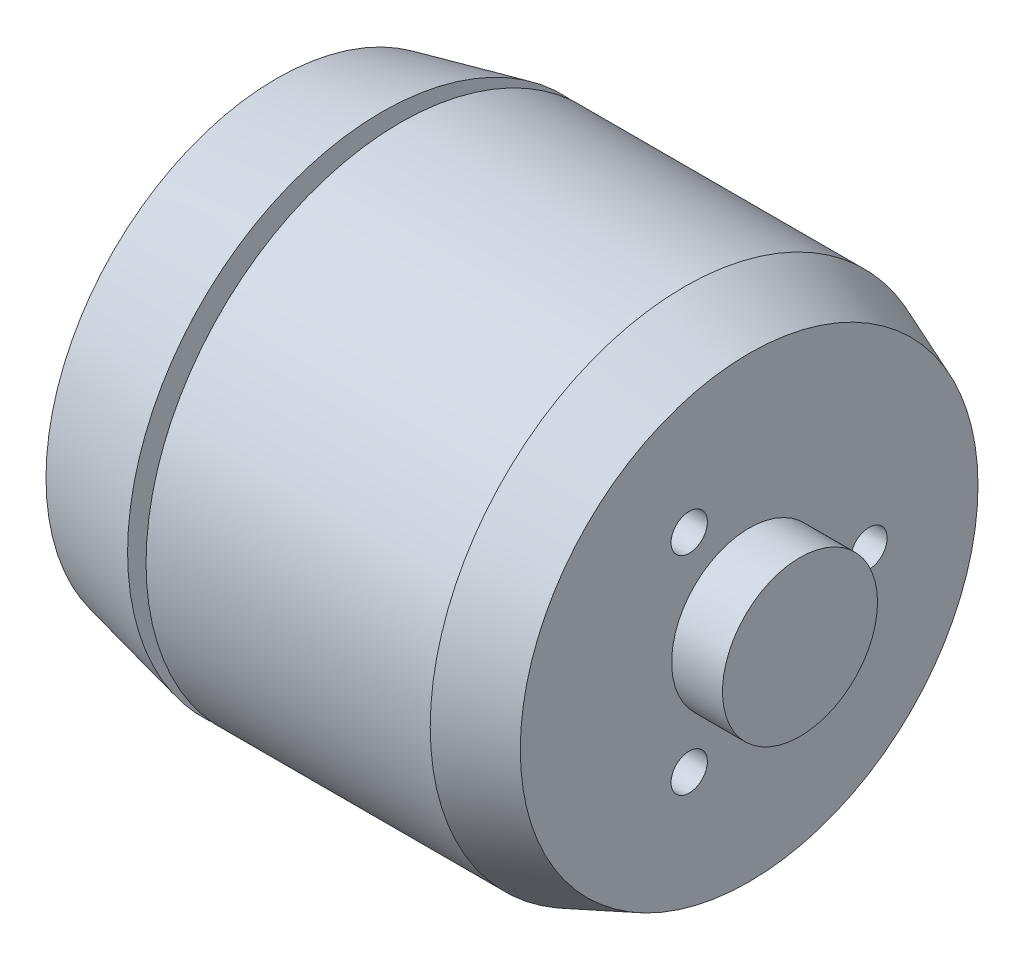
ISO-10303-21;
HEADER;
FILE_DESCRIPTION(('STEP AP214'),'2;1');
FILE_NAME('part.step','',(''),(''),'','','');
FILE_SCHEMA(('AUTOMOTIVE_DESIGN { 1 0 10303 214 1 1 1 1 }'));
ENDSEC;
DATA;
#1=APPLICATION_CONTEXT('core data for automotive mechanical design processes');
#2=APPLICATION_PROTOCOL_DEFINITION('international standard','automotive_design',2000,#1);
#3=PRODUCT_CONTEXT('',#1,'mechanical');
#4=PRODUCT('Part','Part','',(#3));
#5=PRODUCT_RELATED_PRODUCT_CATEGORY('part','',(#4));
#6=PRODUCT_DEFINITION_FORMATION('','',#4);
#7=PRODUCT_DEFINITION_CONTEXT('part definition',#1,'design');
#8=PRODUCT_DEFINITION('design','',#6,#7);
#9=PRODUCT_DEFINITION_SHAPE('','',#8);
#10=(LENGTH_UNIT() NAMED_UNIT(*) SI_UNIT(.MILLI.,.METRE.));
#11=(NAMED_UNIT(*) PLANE_ANGLE_UNIT() SI_UNIT($,.RADIAN.));
#12=(NAMED_UNIT(*) SI_UNIT($,.STERADIAN.) SOLID_ANGLE_UNIT());
#13=UNCERTAINTY_MEASURE_WITH_UNIT(LENGTH_MEASURE(1.E-05),#10,'distance_accuracy_value','');
#14=(GEOMETRIC_REPRESENTATION_CONTEXT(3) GLOBAL_UNCERTAINTY_ASSIGNED_CONTEXT((#13)) GLOBAL_UNIT_ASSIGNED_CONTEXT((#10,
#11,#12)) REPRESENTATION_CONTEXT('',''));
#15=CARTESIAN_POINT('',(0.,0.,0.));
#16=DIRECTION('',(0.,0.,1.));
#17=DIRECTION('',(1.,0.,0.));
#18=AXIS2_PLACEMENT_3D('',#15,#16,#17);
#19=CARTESIAN_POINT('',(28.5,7.1428,4.12389750276767));
#20=DIRECTION('',(1.,0.,0.));
#21=DIRECTION('',(0.,1.,0.));
#22=AXIS2_PLACEMENT_3D('',#19,#20,#21);
#23=PLANE('',#22);
#24=CARTESIAN_POINT('',(28.5,7.1428,4.12389750276767));
#25=DIRECTION('',(1.,0.,0.));
#26=DIRECTION('',(0.,0.,-1.));
#27=AXIS2_PLACEMENT_3D('',#24,#25,#26);
#28=CIRCLE('',#27,1.25);
#29=CARTESIAN_POINT('',(28.5,7.1428,5.37389750276767));
#30=VERTEX_POINT('',#29);
#31=EDGE_CURVE('E273',#30,#30,#28,.T.);
#32=ORIENTED_EDGE('',*,*,#31,.T.);
#33=EDGE_LOOP('',(#32));
#34=FACE_BOUND('',#33,.T.);
#35=ADVANCED_FACE('F17',(#34),#23,.T.);
#36=CARTESIAN_POINT('',(28.5,-7.1428,4.12389750276767));
#37=DIRECTION('',(1.,0.,0.));
#38=DIRECTION('',(0.,1.,0.));
#39=AXIS2_PLACEMENT_3D('',#36,#37,#38);
#40=PLANE('',#39);
#41=CARTESIAN_POINT('',(28.5,-7.1428,4.12389750276767));
#42=DIRECTION('',(1.,0.,0.));
#43=DIRECTION('',(0.,0.,-1.));
#44=AXIS2_PLACEMENT_3D('',#41,#42,#43);
#45=CIRCLE('',#44,1.25);
#46=CARTESIAN_POINT('',(28.5,-7.1428,5.37389750276767));
#47=VERTEX_POINT('',#46);
#48=EDGE_CURVE('E280',#47,#47,#45,.T.);
#49=ORIENTED_EDGE('',*,*,#48,.T.);
#50=EDGE_LOOP('',(#49));
#51=FACE_BOUND('',#50,.T.);
#52=ADVANCED_FACE('F644',(#51),#40,.T.);
#53=CARTESIAN_POINT('',(28.5,0.,-8.24779500553533));
#54=DIRECTION('',(1.,0.,0.));
#55=DIRECTION('',(0.,1.,0.));
#56=AXIS2_PLACEMENT_3D('',#53,#54,#55);
#57=PLANE('',#56);
#58=CARTESIAN_POINT('',(28.5,0.,-8.24779500553533));
#59=DIRECTION('',(1.,0.,0.));
#60=DIRECTION('',(0.,0.,-1.));
#61=AXIS2_PLACEMENT_3D('',#58,#59,#60);
#62=CIRCLE('',#61,1.25);
#63=CARTESIAN_POINT('',(28.5,0.,-6.99779500553533));
#64=VERTEX_POINT('',#63);
#65=EDGE_CURVE('E221',#64,#64,#62,.T.);
#66=ORIENTED_EDGE('',*,*,#65,.T.);
#67=EDGE_LOOP('',(#66));
#68=FACE_BOUND('',#67,.T.);
#69=ADVANCED_FACE('F649',(#68),#57,.T.);
#70=CARTESIAN_POINT('',(0.,0.,0.));
#71=DIRECTION('',(0.,0.,-1.));
#72=DIRECTION('',(0.,-1.,0.));
#73=AXIS2_PLACEMENT_3D('',#70,#71,#72);
#74=PLANE('',#73);
#75=DIRECTION('',(0.,1.,0.));
#76=VECTOR('',#75,1.);
#77=CARTESIAN_POINT('',(6.9854,-5.08,0.));
#78=LINE('',#77,#76);
#79=CARTESIAN_POINT('',(6.9854,-5.08,0.));
#80=VERTEX_POINT('',#79);
#81=CARTESIAN_POINT('',(6.9854,5.08,0.));
#82=VERTEX_POINT('',#81);
#83=EDGE_CURVE('E298',#80,#82,#78,.T.);
#84=ORIENTED_EDGE('',*,*,#83,.F.);
#85=DIRECTION('',(1.,0.,0.));
#86=VECTOR('',#85,1.);
#87=CARTESIAN_POINT('',(2.2356,-5.08,0.));
#88=LINE('',#87,#86);
#89=CARTESIAN_POINT('',(2.2356,-5.08,0.));
#90=VERTEX_POINT('',#89);
#91=EDGE_CURVE('E242',#90,#80,#88,.T.);
#92=ORIENTED_EDGE('',*,*,#91,.F.);
#93=DIRECTION('',(0.,-1.,0.));
#94=VECTOR('',#93,1.);
#95=CARTESIAN_POINT('',(2.2356,-5.08,0.));
#96=LINE('',#95,#94);
#97=CARTESIAN_POINT('',(2.2356,5.08,0.));
#98=VERTEX_POINT('',#97);
#99=EDGE_CURVE('E11',#98,#90,#96,.T.);
#100=ORIENTED_EDGE('',*,*,#99,.F.);
#101=DIRECTION('',(-1.,0.,0.));
#102=VECTOR('',#101,1.);
#103=CARTESIAN_POINT('',(2.2356,5.08,0.));
#104=LINE('',#103,#102);
#105=EDGE_CURVE('E316',#82,#98,#104,.T.);
#106=ORIENTED_EDGE('',*,*,#105,.F.);
#107=EDGE_LOOP('',(#84,#92,#100,#106));
#108=FACE_BOUND('',#107,.T.);
#109=ADVANCED_FACE('F774',(#108),#74,.T.);
#110=CARTESIAN_POINT('',(2.2356,-5.08,-17.5));
#111=DIRECTION('',(-1.,0.,0.));
#112=DIRECTION('',(0.,0.,1.));
#113=AXIS2_PLACEMENT_3D('',#110,#111,#112);
#114=PLANE('',#113);
#115=CARTESIAN_POINT('',(2.2356,0.,-11.0612));
#116=DIRECTION('',(1.,0.,0.));
#117=DIRECTION('',(0.,0.,1.));
#118=AXIS2_PLACEMENT_3D('',#115,#116,#117);
#119=CIRCLE('',#118,4.);
#120=CARTESIAN_POINT('',(2.2356,0.,-15.0612));
#121=VERTEX_POINT('',#120);
#122=EDGE_CURVE('E294',#121,#121,#119,.T.);
#123=ORIENTED_EDGE('',*,*,#122,.F.);
#124=EDGE_LOOP('',(#123));
#125=FACE_BOUND('',#124,.T.);
#126=DIRECTION('',(0.,0.,1.));
#127=VECTOR('',#126,1.);
#128=CARTESIAN_POINT('',(2.2356,5.08,-17.5));
#129=LINE('',#128,#127);
#130=CARTESIAN_POINT('',(2.2356,5.08,-15.3348552618978));
#131=VERTEX_POINT('',#130);
#132=EDGE_CURVE('E28',#131,#98,#129,.T.);
#133=ORIENTED_EDGE('',*,*,#132,.T.);
#134=ORIENTED_EDGE('',*,*,#99,.T.);
#135=DIRECTION('',(0.,0.,1.));
#136=VECTOR('',#135,1.);
#137=CARTESIAN_POINT('',(2.2356,-5.08,-17.5));
#138=LINE('',#137,#136);
#139=CARTESIAN_POINT('',(2.2356,-5.08,-15.3348552618978));
#140=VERTEX_POINT('',#139);
#141=EDGE_CURVE('E238',#140,#90,#138,.T.);
#142=ORIENTED_EDGE('',*,*,#141,.F.);
#143=CARTESIAN_POINT('',(2.2356,0.,0.));
#144=DIRECTION('',(-1.,0.,0.));
#145=DIRECTION('',(0.,0.,1.));
#146=AXIS2_PLACEMENT_3D('',#143,#144,#145);
#147=CIRCLE('',#146,16.1543859649123);
#148=EDGE_CURVE('E256',#131,#140,#147,.T.);
#149=ORIENTED_EDGE('',*,*,#148,.F.);
#150=EDGE_LOOP('',(#133,#134,#142,#149));
#151=FACE_BOUND('',#150,.T.);
#152=ADVANCED_FACE('F697',(#125,#151),#114,.F.);
#153=CARTESIAN_POINT('',(2.2356,5.08,-17.5));
#154=DIRECTION('',(0.,1.,0.));
#155=DIRECTION('',(1.,0.,0.));
#156=AXIS2_PLACEMENT_3D('',#153,#154,#155);
#157=PLANE('',#156);
#158=DIRECTION('',(0.,0.,1.));
#159=VECTOR('',#158,1.);
#160=CARTESIAN_POINT('',(6.9854,5.08,-17.5));
#161=LINE('',#160,#159);
#162=CARTESIAN_POINT('',(6.9854,5.08,-16.4542744521131));
#163=VERTEX_POINT('',#162);
#164=EDGE_CURVE('E243',#163,#82,#161,.T.);
#165=ORIENTED_EDGE('',*,*,#164,.T.);
#166=ORIENTED_EDGE('',*,*,#105,.T.);
#167=ORIENTED_EDGE('',*,*,#132,.F.);
#168=CARTESIAN_POINT('',(6.9854,5.08,-16.4542744521131));
#169=CARTESIAN_POINT('',(5.40187085771314,5.08,-16.0822506345086));
#170=CARTESIAN_POINT('',(3.81858512751309,5.08,-15.7091919528578));
#171=CARTESIAN_POINT('',(2.2356,5.08,-15.3348552618978));
#172=(BOUNDED_CURVE() B_SPLINE_CURVE(3,(#168,#169,#170,#171),.UNSPECIFIED.,.F.,
.F.) B_SPLINE_CURVE_WITH_KNOTS((4,4),(0.0186183002080263,0.0234982279464003),
.UNSPECIFIED.) CURVE() GEOMETRIC_REPRESENTATION_ITEM() RATIONAL_B_SPLINE_CURVE((1.,1.,1.,1.)) REPRESENTATION_ITEM(''));
#173=EDGE_CURVE('E327',#163,#131,#172,.T.);
#174=ORIENTED_EDGE('',*,*,#173,.F.);
#175=EDGE_LOOP('',(#165,#166,#167,#174));
#176=FACE_BOUND('',#175,.T.);
#177=ADVANCED_FACE('F693',(#176),#157,.F.);
#178=CARTESIAN_POINT('',(2.2356,-5.08,-17.5));
#179=DIRECTION('',(0.,-1.,0.));
#180=DIRECTION('',(0.,0.,-1.));
#181=AXIS2_PLACEMENT_3D('',#178,#179,#180);
#182=PLANE('',#181);
#183=ORIENTED_EDGE('',*,*,#141,.T.);
#184=ORIENTED_EDGE('',*,*,#91,.T.);
#185=DIRECTION('',(0.,0.,1.));
#186=VECTOR('',#185,1.);
#187=CARTESIAN_POINT('',(6.9854,-5.08,-17.5));
#188=LINE('',#187,#186);
#189=CARTESIAN_POINT('',(6.9854,-5.08,-16.4542744521131));
#190=VERTEX_POINT('',#189);
#191=EDGE_CURVE('E205',#190,#80,#188,.T.);
#192=ORIENTED_EDGE('',*,*,#191,.F.);
#193=CARTESIAN_POINT('',(2.2356,-5.08,-15.3348552618978));
#194=CARTESIAN_POINT('',(3.81858357885327,-5.08,-15.7091915866381));
#195=CARTESIAN_POINT('',(5.40187240379924,-5.08,-16.0822509977358));
#196=CARTESIAN_POINT('',(6.9854,-5.08,-16.4542744521131));
#197=(BOUNDED_CURVE() B_SPLINE_CURVE(3,(#193,#194,#195,#196),.UNSPECIFIED.,.F.,
.F.) B_SPLINE_CURVE_WITH_KNOTS((4,4),(0.0186526350852368,0.0235325216490011),
.UNSPECIFIED.) CURVE() GEOMETRIC_REPRESENTATION_ITEM() RATIONAL_B_SPLINE_CURVE((1.,1.,1.,1.)) REPRESENTATION_ITEM(''));
#198=EDGE_CURVE('E328',#140,#190,#197,.T.);
#199=ORIENTED_EDGE('',*,*,#198,.F.);
#200=EDGE_LOOP('',(#183,#184,#192,#199));
#201=FACE_BOUND('',#200,.T.);
#202=ADVANCED_FACE('F696',(#201),#182,.F.);
#203=CARTESIAN_POINT('',(6.9854,-5.08,-17.5));
#204=DIRECTION('',(1.,0.,0.));
#205=DIRECTION('',(0.,1.,0.));
#206=AXIS2_PLACEMENT_3D('',#203,#204,#205);
#207=PLANE('',#206);
#208=ORIENTED_EDGE('',*,*,#191,.T.);
#209=ORIENTED_EDGE('',*,*,#83,.T.);
#210=ORIENTED_EDGE('',*,*,#164,.F.);
#211=CARTESIAN_POINT('',(6.9854,0.,0.));
#212=DIRECTION('',(1.,0.,0.));
#213=DIRECTION('',(0.,0.,-1.));
#214=AXIS2_PLACEMENT_3D('',#211,#212,#213);
#215=CIRCLE('',#214,17.2206140350877);
#216=EDGE_CURVE('E323',#190,#163,#215,.T.);
#217=ORIENTED_EDGE('',*,*,#216,.F.);
#218=EDGE_LOOP('',(#208,#209,#210,#217));
#219=FACE_BOUND('',#218,.T.);
#220=ADVANCED_FACE('F639',(#219),#207,.F.);
#221=CARTESIAN_POINT('',(5.436,-11.0612,0.));
#222=DIRECTION('',(-1.,0.,0.));
#223=DIRECTION('',(0.,0.,1.));
#224=AXIS2_PLACEMENT_3D('',#221,#222,#223);
#225=PLANE('',#224);
#226=CARTESIAN_POINT('',(5.436,-11.0612,0.));
#227=DIRECTION('',(-1.,0.,0.));
#228=DIRECTION('',(0.,0.,1.));
#229=AXIS2_PLACEMENT_3D('',#226,#227,#228);
#230=CIRCLE('',#229,4.);
#231=CARTESIAN_POINT('',(5.436,-11.0612,-4.));
#232=VERTEX_POINT('',#231);
#233=EDGE_CURVE('E372',#232,#232,#230,.T.);
#234=ORIENTED_EDGE('',*,*,#233,.T.);
#235=EDGE_LOOP('',(#234));
#236=FACE_BOUND('',#235,.T.);
#237=ADVANCED_FACE('F630',(#236),#225,.T.);
#238=CARTESIAN_POINT('',(5.436,-6.71751442127222,-6.71751442127219));
#239=DIRECTION('',(-1.,0.,0.));
#240=DIRECTION('',(0.,0.,1.));
#241=AXIS2_PLACEMENT_3D('',#238,#239,#240);
#242=PLANE('',#241);
#243=CARTESIAN_POINT('',(5.436,-6.71751442127222,-6.71751442127219));
#244=DIRECTION('',(-1.,0.,0.));
#245=DIRECTION('',(0.,0.,1.));
#246=AXIS2_PLACEMENT_3D('',#243,#244,#245);
#247=CIRCLE('',#246,1.5);
#248=CARTESIAN_POINT('',(5.436,-6.71751442127222,-8.21751442127219));
#249=VERTEX_POINT('',#248);
#250=EDGE_CURVE('E357',#249,#249,#247,.T.);
#251=ORIENTED_EDGE('',*,*,#250,.T.);
#252=EDGE_LOOP('',(#251));
#253=FACE_BOUND('',#252,.T.);
#254=ADVANCED_FACE('F628',(#253),#242,.T.);
#255=CARTESIAN_POINT('',(5.436,8.83883476483182,-8.83883476483186));
#256=DIRECTION('',(-1.,0.,0.));
#257=DIRECTION('',(0.,0.,1.));
#258=AXIS2_PLACEMENT_3D('',#255,#256,#257);
#259=PLANE('',#258);
#260=CARTESIAN_POINT('',(5.436,8.83883476483182,-8.83883476483186));
#261=DIRECTION('',(-1.,0.,0.));
#262=DIRECTION('',(0.,0.,1.));
#263=AXIS2_PLACEMENT_3D('',#260,#261,#262);
#264=CIRCLE('',#263,1.5);
#265=CARTESIAN_POINT('',(5.436,8.83883476483182,-10.3388347648319));
#266=VERTEX_POINT('',#265);
#267=EDGE_CURVE('E231',#266,#266,#264,.T.);
#268=ORIENTED_EDGE('',*,*,#267,.T.);
#269=EDGE_LOOP('',(#268));
#270=FACE_BOUND('',#269,.T.);
#271=ADVANCED_FACE('F424',(#270),#259,.T.);
#272=CARTESIAN_POINT('',(5.436,-8.83883476483183,8.83883476483186));
#273=DIRECTION('',(-1.,0.,0.));
#274=DIRECTION('',(0.,0.,1.));
#275=AXIS2_PLACEMENT_3D('',#272,#273,#274);
#276=PLANE('',#275);
#277=CARTESIAN_POINT('',(5.436,-8.83883476483183,8.83883476483186));
#278=DIRECTION('',(-1.,0.,0.));
#279=DIRECTION('',(0.,0.,1.));
#280=AXIS2_PLACEMENT_3D('',#277,#278,#279);
#281=CIRCLE('',#280,1.5);
#282=CARTESIAN_POINT('',(5.436,-8.83883476483183,7.33883476483186));
#283=VERTEX_POINT('',#282);
#284=EDGE_CURVE('E226',#283,#283,#281,.T.);
#285=ORIENTED_EDGE('',*,*,#284,.T.);
#286=EDGE_LOOP('',(#285));
#287=FACE_BOUND('',#286,.T.);
#288=ADVANCED_FACE('F637',(#287),#276,.T.);
#289=CARTESIAN_POINT('',(5.436,11.0612,0.));
#290=DIRECTION('',(-1.,0.,0.));
#291=DIRECTION('',(0.,0.,1.));
#292=AXIS2_PLACEMENT_3D('',#289,#290,#291);
#293=PLANE('',#292);
#294=CARTESIAN_POINT('',(5.436,11.0612,0.));
#295=DIRECTION('',(-1.,0.,0.));
#296=DIRECTION('',(0.,0.,1.));
#297=AXIS2_PLACEMENT_3D('',#294,#295,#296);
#298=CIRCLE('',#297,4.);
#299=CARTESIAN_POINT('',(5.436,11.0612,-4.));
#300=VERTEX_POINT('',#299);
#301=EDGE_CURVE('E263',#300,#300,#298,.T.);
#302=ORIENTED_EDGE('',*,*,#301,.T.);
#303=EDGE_LOOP('',(#302));
#304=FACE_BOUND('',#303,.T.);
#305=ADVANCED_FACE('F683',(#304),#293,.T.);
#306=CARTESIAN_POINT('',(5.436,0.,11.0612));
#307=DIRECTION('',(-1.,0.,0.));
#308=DIRECTION('',(0.,0.,1.));
#309=AXIS2_PLACEMENT_3D('',#306,#307,#308);
#310=PLANE('',#309);
#311=CARTESIAN_POINT('',(5.436,0.,11.0612));
#312=DIRECTION('',(-1.,0.,0.));
#313=DIRECTION('',(0.,0.,1.));
#314=AXIS2_PLACEMENT_3D('',#311,#312,#313);
#315=CIRCLE('',#314,4.);
#316=CARTESIAN_POINT('',(5.436,0.,7.0612));
#317=VERTEX_POINT('',#316);
#318=EDGE_CURVE('E366',#317,#317,#315,.T.);
#319=ORIENTED_EDGE('',*,*,#318,.T.);
#320=EDGE_LOOP('',(#319));
#321=FACE_BOUND('',#320,.T.);
#322=ADVANCED_FACE('F688',(#321),#310,.T.);
#323=CARTESIAN_POINT('',(5.436,6.71751442127222,6.71751442127219));
#324=DIRECTION('',(-1.,0.,0.));
#325=DIRECTION('',(0.,0.,1.));
#326=AXIS2_PLACEMENT_3D('',#323,#324,#325);
#327=PLANE('',#326);
#328=CARTESIAN_POINT('',(5.436,6.71751442127222,6.71751442127219));
#329=DIRECTION('',(-1.,0.,0.));
#330=DIRECTION('',(0.,0.,1.));
#331=AXIS2_PLACEMENT_3D('',#328,#329,#330);
#332=CIRCLE('',#331,1.5);
#333=CARTESIAN_POINT('',(5.436,6.71751442127222,5.21751442127219));
#334=VERTEX_POINT('',#333);
#335=EDGE_CURVE('E236',#334,#334,#332,.T.);
#336=ORIENTED_EDGE('',*,*,#335,.T.);
#337=EDGE_LOOP('',(#336));
#338=FACE_BOUND('',#337,.T.);
#339=ADVANCED_FACE('F732',(#338),#327,.T.);
#340=CARTESIAN_POINT('',(37.,0.,-5.334));
#341=DIRECTION('',(-1.,0.,0.));
#342=DIRECTION('',(0.,0.,1.));
#343=AXIS2_PLACEMENT_3D('',#340,#341,#342);
#344=PLANE('',#343);
#345=CARTESIAN_POINT('',(37.,0.,0.));
#346=DIRECTION('',(-1.,0.,0.));
#347=DIRECTION('',(0.,0.,1.));
#348=AXIS2_PLACEMENT_3D('',#345,#346,#347);
#349=CIRCLE('',#348,5.334);
#350=CARTESIAN_POINT('',(37.,0.,-5.334));
#351=VERTEX_POINT('',#350);
#352=EDGE_CURVE('E189',#351,#351,#349,.T.);
#353=ORIENTED_EDGE('',*,*,#352,.F.);
#354=EDGE_LOOP('',(#353));
#355=FACE_BOUND('',#354,.T.);
#356=ADVANCED_FACE('F735',(#355),#344,.F.);
#357=CARTESIAN_POINT('',(33.5,0.,-15.748));
#358=DIRECTION('',(-1.,0.,0.));
#359=DIRECTION('',(0.,0.,1.));
#360=AXIS2_PLACEMENT_3D('',#357,#358,#359);
#361=PLANE('',#360);
#362=CARTESIAN_POINT('',(33.5,0.,-8.24779500553533));
#363=DIRECTION('',(1.,0.,0.));
#364=DIRECTION('',(0.,0.,-1.));
#365=AXIS2_PLACEMENT_3D('',#362,#363,#364);
#366=CIRCLE('',#365,1.25);
#367=CARTESIAN_POINT('',(33.5,0.,-6.99779500553533));
#368=VERTEX_POINT('',#367);
#369=EDGE_CURVE('E220',#368,#368,#366,.T.);
#370=ORIENTED_EDGE('',*,*,#369,.F.);
#371=EDGE_LOOP('',(#370));
#372=FACE_BOUND('',#371,.T.);
#373=CARTESIAN_POINT('',(33.5,-7.1428,4.12389750276767));
#374=DIRECTION('',(1.,0.,0.));
#375=DIRECTION('',(0.,0.,-1.));
#376=AXIS2_PLACEMENT_3D('',#373,#374,#375);
#377=CIRCLE('',#376,1.25);
#378=CARTESIAN_POINT('',(33.5,-7.1428,5.37389750276767));
#379=VERTEX_POINT('',#378);
#380=EDGE_CURVE('E265',#379,#379,#377,.T.);
#381=ORIENTED_EDGE('',*,*,#380,.F.);
#382=EDGE_LOOP('',(#381));
#383=FACE_BOUND('',#382,.T.);
#384=CARTESIAN_POINT('',(33.5,7.1428,4.12389750276767));
#385=DIRECTION('',(1.,0.,0.));
#386=DIRECTION('',(0.,0.,-1.));
#387=AXIS2_PLACEMENT_3D('',#384,#385,#386);
#388=CIRCLE('',#387,1.25);
#389=CARTESIAN_POINT('',(33.5,7.1428,5.37389750276767));
#390=VERTEX_POINT('',#389);
#391=EDGE_CURVE('E272',#390,#390,#388,.T.);
#392=ORIENTED_EDGE('',*,*,#391,.F.);
#393=EDGE_LOOP('',(#392));
#394=FACE_BOUND('',#393,.T.);
#395=CARTESIAN_POINT('',(33.5,0.,0.));
#396=DIRECTION('',(-1.,0.,0.));
#397=DIRECTION('',(0.,0.,1.));
#398=AXIS2_PLACEMENT_3D('',#395,#396,#397);
#399=CIRCLE('',#398,5.334);
#400=CARTESIAN_POINT('',(33.5,0.,-5.334));
#401=VERTEX_POINT('',#400);
#402=EDGE_CURVE('E187',#401,#401,#399,.T.);
#403=ORIENTED_EDGE('',*,*,#402,.T.);
#404=EDGE_LOOP('',(#403));
#405=FACE_BOUND('',#404,.T.);
#406=CARTESIAN_POINT('',(33.5,0.,0.));
#407=DIRECTION('',(-1.,0.,0.));
#408=DIRECTION('',(0.,0.,1.));
#409=AXIS2_PLACEMENT_3D('',#406,#407,#408);
#410=CIRCLE('',#409,15.748);
#411=CARTESIAN_POINT('',(33.5,0.,-15.748));
#412=VERTEX_POINT('',#411);
#413=EDGE_CURVE('E212',#412,#412,#410,.T.);
#414=ORIENTED_EDGE('',*,*,#413,.F.);
#415=EDGE_LOOP('',(#414));
#416=FACE_BOUND('',#415,.T.);
#417=ADVANCED_FACE('F193',(#372,#383,#394,#405,#416),#361,.F.);
#418=CARTESIAN_POINT('',(9.5,0.,-17.5));
#419=DIRECTION('',(1.,0.,0.));
#420=DIRECTION('',(0.,1.,0.));
#421=AXIS2_PLACEMENT_3D('',#418,#419,#420);
#422=PLANE('',#421);
#423=CARTESIAN_POINT('',(9.5,0.,0.));
#424=DIRECTION('',(-1.,0.,0.));
#425=DIRECTION('',(0.,0.,1.));
#426=AXIS2_PLACEMENT_3D('',#423,#424,#425);
#427=CIRCLE('',#426,12.5);
#428=CARTESIAN_POINT('',(9.5,0.,-12.5));
#429=VERTEX_POINT('',#428);
#430=EDGE_CURVE('E313',#429,#429,#427,.T.);
#431=ORIENTED_EDGE('',*,*,#430,.F.);
#432=EDGE_LOOP('',(#431));
#433=FACE_BOUND('',#432,.T.);
#434=CARTESIAN_POINT('',(9.5,0.,0.));
#435=DIRECTION('',(-1.,0.,0.));
#436=DIRECTION('',(0.,0.,1.));
#437=AXIS2_PLACEMENT_3D('',#434,#435,#436);
#438=CIRCLE('',#437,17.5);
#439=CARTESIAN_POINT('',(9.5,0.,-17.5));
#440=VERTEX_POINT('',#439);
#441=EDGE_CURVE('E215',#440,#440,#438,.T.);
#442=ORIENTED_EDGE('',*,*,#441,.T.);
#443=EDGE_LOOP('',(#442));
#444=FACE_BOUND('',#443,.T.);
#445=ADVANCED_FACE('F725',(#433,#444),#422,.F.);
#446=CARTESIAN_POINT('',(8.23,0.,-12.5));
#447=DIRECTION('',(-1.,0.,0.));
#448=DIRECTION('',(0.,0.,1.));
#449=AXIS2_PLACEMENT_3D('',#446,#447,#448);
#450=PLANE('',#449);
#451=CARTESIAN_POINT('',(8.23,0.,0.));
#452=DIRECTION('',(-1.,0.,0.));
#453=DIRECTION('',(0.,0.,1.));
#454=AXIS2_PLACEMENT_3D('',#451,#452,#453);
#455=CIRCLE('',#454,12.5);
#456=CARTESIAN_POINT('',(8.23,0.,-12.5));
#457=VERTEX_POINT('',#456);
#458=EDGE_CURVE('E259',#457,#457,#455,.T.);
#459=ORIENTED_EDGE('',*,*,#458,.T.);
#460=EDGE_LOOP('',(#459));
#461=FACE_BOUND('',#460,.T.);
#462=CARTESIAN_POINT('',(8.23,0.,0.));
#463=DIRECTION('',(-1.,0.,0.));
#464=DIRECTION('',(0.,0.,1.));
#465=AXIS2_PLACEMENT_3D('',#462,#463,#464);
#466=CIRCLE('',#465,17.5);
#467=CARTESIAN_POINT('',(8.23,0.,17.5));
#468=VERTEX_POINT('',#467);
#469=EDGE_CURVE('E407',#468,#468,#466,.T.);
#470=ORIENTED_EDGE('',*,*,#469,.F.);
#471=EDGE_LOOP('',(#470));
#472=FACE_BOUND('',#471,.T.);
#473=ADVANCED_FACE('F435',(#461,#472),#450,.F.);
#474=CARTESIAN_POINT('',(0.991,0.,-15.875));
#475=DIRECTION('',(1.,0.,0.));
#476=DIRECTION('',(0.,1.,0.));
#477=AXIS2_PLACEMENT_3D('',#474,#475,#476);
#478=PLANE('',#477);
#479=CARTESIAN_POINT('',(0.99100000000002,0.,0.));
#480=DIRECTION('',(-1.,0.,0.));
#481=DIRECTION('',(0.,0.,1.));
#482=AXIS2_PLACEMENT_3D('',#479,#480,#481);
#483=CIRCLE('',#482,2.5);
#484=CARTESIAN_POINT('',(0.991000000000035,0.,-2.5));
#485=VERTEX_POINT('',#484);
#486=EDGE_CURVE('E335',#485,#485,#483,.T.);
#487=ORIENTED_EDGE('',*,*,#486,.F.);
#488=EDGE_LOOP('',(#487));
#489=FACE_BOUND('',#488,.T.);
#490=CARTESIAN_POINT('',(0.991,6.71751442127222,6.71751442127219));
#491=DIRECTION('',(-1.,0.,0.));
#492=DIRECTION('',(0.,0.,1.));
#493=AXIS2_PLACEMENT_3D('',#490,#491,#492);
#494=CIRCLE('',#493,1.5);
#495=CARTESIAN_POINT('',(0.991,6.71751442127222,5.21751442127219));
#496=VERTEX_POINT('',#495);
#497=EDGE_CURVE('E177',#496,#496,#494,.T.);
#498=ORIENTED_EDGE('',*,*,#497,.F.);
#499=EDGE_LOOP('',(#498));
#500=FACE_BOUND('',#499,.T.);
#501=CARTESIAN_POINT('',(0.991,0.,11.0612));
#502=DIRECTION('',(-1.,0.,0.));
#503=DIRECTION('',(0.,0.,1.));
#504=AXIS2_PLACEMENT_3D('',#501,#502,#503);
#505=CIRCLE('',#504,4.);
#506=CARTESIAN_POINT('',(0.991,0.,7.0612));
#507=VERTEX_POINT('',#506);
#508=EDGE_CURVE('E232',#507,#507,#505,.T.);
#509=ORIENTED_EDGE('',*,*,#508,.F.);
#510=EDGE_LOOP('',(#509));
#511=FACE_BOUND('',#510,.T.);
#512=CARTESIAN_POINT('',(0.991,11.0612,0.));
#513=DIRECTION('',(-1.,0.,0.));
#514=DIRECTION('',(0.,0.,1.));
#515=AXIS2_PLACEMENT_3D('',#512,#513,#514);
#516=CIRCLE('',#515,4.);
#517=CARTESIAN_POINT('',(0.991,11.0612,-4.));
#518=VERTEX_POINT('',#517);
#519=EDGE_CURVE('E363',#518,#518,#516,.T.);
#520=ORIENTED_EDGE('',*,*,#519,.F.);
#521=EDGE_LOOP('',(#520));
#522=FACE_BOUND('',#521,.T.);
#523=CARTESIAN_POINT('',(0.991,0.,-11.0612));
#524=DIRECTION('',(-1.,0.,0.));
#525=DIRECTION('',(0.,0.,1.));
#526=AXIS2_PLACEMENT_3D('',#523,#524,#525);
#527=CIRCLE('',#526,4.);
#528=CARTESIAN_POINT('',(0.991,0.,-15.0612));
#529=VERTEX_POINT('',#528);
#530=EDGE_CURVE('E260',#529,#529,#527,.T.);
#531=ORIENTED_EDGE('',*,*,#530,.F.);
#532=EDGE_LOOP('',(#531));
#533=FACE_BOUND('',#532,.T.);
#534=CARTESIAN_POINT('',(0.991,-8.83883476483183,8.83883476483186));
#535=DIRECTION('',(-1.,0.,0.));
#536=DIRECTION('',(0.,0.,1.));
#537=AXIS2_PLACEMENT_3D('',#534,#535,#536);
#538=CIRCLE('',#537,1.5);
#539=CARTESIAN_POINT('',(0.991,-8.83883476483183,7.33883476483186));
#540=VERTEX_POINT('',#539);
#541=EDGE_CURVE('E293',#540,#540,#538,.T.);
#542=ORIENTED_EDGE('',*,*,#541,.F.);
#543=EDGE_LOOP('',(#542));
#544=FACE_BOUND('',#543,.T.);
#545=CARTESIAN_POINT('',(0.991,8.83883476483182,-8.83883476483186));
#546=DIRECTION('',(-1.,0.,0.));
#547=DIRECTION('',(0.,0.,1.));
#548=AXIS2_PLACEMENT_3D('',#545,#546,#547);
#549=CIRCLE('',#548,1.5);
#550=CARTESIAN_POINT('',(0.991,8.83883476483182,-10.3388347648319));
#551=VERTEX_POINT('',#550);
#552=EDGE_CURVE('E222',#551,#551,#549,.T.);
#553=ORIENTED_EDGE('',*,*,#552,.F.);
#554=EDGE_LOOP('',(#553));
#555=FACE_BOUND('',#554,.T.);
#556=CARTESIAN_POINT('',(0.991,-6.71751442127222,-6.71751442127219));
#557=DIRECTION('',(-1.,0.,0.));
#558=DIRECTION('',(0.,0.,1.));
#559=AXIS2_PLACEMENT_3D('',#556,#557,#558);
#560=CIRCLE('',#559,1.5);
#561=CARTESIAN_POINT('',(0.991,-6.71751442127222,-8.21751442127219));
#562=VERTEX_POINT('',#561);
#563=EDGE_CURVE('E228',#562,#562,#560,.T.);
#564=ORIENTED_EDGE('',*,*,#563,.F.);
#565=EDGE_LOOP('',(#564));
#566=FACE_BOUND('',#565,.T.);
#567=CARTESIAN_POINT('',(0.991,-11.0612,0.));
#568=DIRECTION('',(-1.,0.,0.));
#569=DIRECTION('',(0.,0.,1.));
#570=AXIS2_PLACEMENT_3D('',#567,#568,#569);
#571=CIRCLE('',#570,4.);
#572=CARTESIAN_POINT('',(0.991,-11.0612,-4.));
#573=VERTEX_POINT('',#572);
#574=EDGE_CURVE('E142',#573,#573,#571,.T.);
#575=ORIENTED_EDGE('',*,*,#574,.F.);
#576=EDGE_LOOP('',(#575));
#577=FACE_BOUND('',#576,.T.);
#578=CARTESIAN_POINT('',(0.99100000000002,0.,0.));
#579=DIRECTION('',(-1.,0.,0.));
#580=DIRECTION('',(0.,0.,1.));
#581=AXIS2_PLACEMENT_3D('',#578,#579,#580);
#582=CIRCLE('',#581,15.875);
#583=CARTESIAN_POINT('',(0.991000000000021,0.,15.875));
#584=VERTEX_POINT('',#583);
#585=EDGE_CURVE('E253',#584,#584,#582,.T.);
#586=ORIENTED_EDGE('',*,*,#585,.T.);
#587=EDGE_LOOP('',(#586));
#588=FACE_BOUND('',#587,.T.);
#589=ADVANCED_FACE('F431',(#489,#500,#511,#522,#533,#544,#555,#566,#577,#588),#478,.F.);
#590=CARTESIAN_POINT('',(0.,0.,-2.5));
#591=DIRECTION('',(1.,0.,0.));
#592=DIRECTION('',(0.,1.,0.));
#593=AXIS2_PLACEMENT_3D('',#590,#591,#592);
#594=PLANE('',#593);
#595=CARTESIAN_POINT('',(0.,0.,0.));
#596=DIRECTION('',(-1.,0.,0.));
#597=DIRECTION('',(0.,0.,1.));
#598=AXIS2_PLACEMENT_3D('',#595,#596,#597);
#599=CIRCLE('',#598,2.5);
#600=CARTESIAN_POINT('',(0.,0.,-2.5));
#601=VERTEX_POINT('',#600);
#602=EDGE_CURVE('E390',#601,#601,#599,.T.);
#603=ORIENTED_EDGE('',*,*,#602,.T.);
#604=EDGE_LOOP('',(#603));
#605=FACE_BOUND('',#604,.T.);
#606=ADVANCED_FACE('F434',(#605),#594,.F.);
#607=CARTESIAN_POINT('',(-287.397520162874,0.,0.));
#608=DIRECTION('',(-1.,0.,0.));
#609=DIRECTION('',(0.,0.,1.));
#610=AXIS2_PLACEMENT_3D('',#607,#608,#609);
#611=CYLINDRICAL_SURFACE('',#610,2.5);
#612=ORIENTED_EDGE('',*,*,#602,.F.);
#613=DIRECTION('',(1.,0.,0.));
#614=VECTOR('',#613,1.);
#615=CARTESIAN_POINT('',(-287.397520162874,0.,-2.5));
#616=LINE('',#615,#614);
#617=EDGE_CURVE('E338',#601,#485,#616,.T.);
#618=ORIENTED_EDGE('',*,*,#617,.T.);
#619=ORIENTED_EDGE('',*,*,#486,.T.);
#620=ORIENTED_EDGE('',*,*,#617,.F.);
#621=EDGE_LOOP('',(#612,#618,#619,#620));
#622=FACE_BOUND('',#621,.T.);
#623=ADVANCED_FACE('F656',(#622),#611,.T.);
#624=CARTESIAN_POINT('',(8.23,0.,0.));
#625=DIRECTION('',(1.,0.,0.));
#626=DIRECTION('',(0.,0.,-1.));
#627=AXIS2_PLACEMENT_3D('',#624,#625,#626);
#628=CONICAL_SURFACE('',#627,17.5,0.220818033952911);
#629=ORIENTED_EDGE('',*,*,#148,.T.);
#630=ORIENTED_EDGE('',*,*,#198,.T.);
#631=ORIENTED_EDGE('',*,*,#216,.T.);
#632=ORIENTED_EDGE('',*,*,#173,.T.);
#633=EDGE_LOOP('',(#629,#630,#631,#632));
#634=FACE_BOUND('',#633,.T.);
#635=ORIENTED_EDGE('',*,*,#469,.T.);
#636=DIRECTION('',(-0.975718603584016,0.,-0.219027867222548));
#637=VECTOR('',#636,1.);
#638=CARTESIAN_POINT('',(8.23,0.,17.5));
#639=LINE('',#638,#637);
#640=EDGE_CURVE('E21',#468,#584,#639,.T.);
#641=ORIENTED_EDGE('',*,*,#640,.T.);
#642=ORIENTED_EDGE('',*,*,#585,.F.);
#643=ORIENTED_EDGE('',*,*,#640,.F.);
#644=EDGE_LOOP('',(#635,#641,#642,#643));
#645=FACE_BOUND('',#644,.T.);
#646=ADVANCED_FACE('F444',(#634,#645),#628,.T.);
#647=CARTESIAN_POINT('',(-287.397520162874,0.,0.));
#648=DIRECTION('',(-1.,0.,0.));
#649=DIRECTION('',(0.,0.,1.));
#650=AXIS2_PLACEMENT_3D('',#647,#648,#649);
#651=CYLINDRICAL_SURFACE('',#650,12.5);
#652=ORIENTED_EDGE('',*,*,#458,.F.);
#653=DIRECTION('',(1.,0.,0.));
#654=VECTOR('',#653,1.);
#655=CARTESIAN_POINT('',(-287.397520162874,0.,-12.5));
#656=LINE('',#655,#654);
#657=EDGE_CURVE('E309',#457,#429,#656,.T.);
#658=ORIENTED_EDGE('',*,*,#657,.T.);
#659=ORIENTED_EDGE('',*,*,#430,.T.);
#660=ORIENTED_EDGE('',*,*,#657,.F.);
#661=EDGE_LOOP('',(#652,#658,#659,#660));
#662=FACE_BOUND('',#661,.T.);
#663=ADVANCED_FACE('F715',(#662),#651,.T.);
#664=CARTESIAN_POINT('',(-287.397520162874,0.,0.));
#665=DIRECTION('',(-1.,0.,0.));
#666=DIRECTION('',(0.,0.,1.));
#667=AXIS2_PLACEMENT_3D('',#664,#665,#666);
#668=CYLINDRICAL_SURFACE('',#667,17.5);
#669=ORIENTED_EDGE('',*,*,#441,.F.);
#670=DIRECTION('',(1.,0.,0.));
#671=VECTOR('',#670,1.);
#672=CARTESIAN_POINT('',(-287.397520162874,0.,-17.5));
#673=LINE('',#672,#671);
#674=CARTESIAN_POINT('',(29.055,0.,-17.5));
#675=VERTEX_POINT('',#674);
#676=EDGE_CURVE('E252',#440,#675,#673,.T.);
#677=ORIENTED_EDGE('',*,*,#676,.T.);
#678=CARTESIAN_POINT('',(29.055,0.,0.));
#679=DIRECTION('',(-1.,0.,0.));
#680=DIRECTION('',(0.,0.,1.));
#681=AXIS2_PLACEMENT_3D('',#678,#679,#680);
#682=CIRCLE('',#681,17.5);
#683=EDGE_CURVE('E207',#675,#675,#682,.T.);
#684=ORIENTED_EDGE('',*,*,#683,.T.);
#685=ORIENTED_EDGE('',*,*,#676,.F.);
#686=EDGE_LOOP('',(#669,#677,#684,#685));
#687=FACE_BOUND('',#686,.T.);
#688=ADVANCED_FACE('F711',(#687),#668,.T.);
#689=CARTESIAN_POINT('',(33.5,0.,0.));
#690=DIRECTION('',(-1.,0.,0.));
#691=DIRECTION('',(0.,0.,1.));
#692=AXIS2_PLACEMENT_3D('',#689,#690,#691);
#693=CONICAL_SURFACE('',#692,15.748,0.375453755800143);
#694=ORIENTED_EDGE('',*,*,#683,.F.);
#695=DIRECTION('',(0.930341327840394,0.,0.366694714595361));
#696=VECTOR('',#695,1.);
#697=CARTESIAN_POINT('',(33.5,0.,-15.748));
#698=LINE('',#697,#696);
#699=EDGE_CURVE('E211',#675,#412,#698,.T.);
#700=ORIENTED_EDGE('',*,*,#699,.T.);
#701=ORIENTED_EDGE('',*,*,#413,.T.);
#702=ORIENTED_EDGE('',*,*,#699,.F.);
#703=EDGE_LOOP('',(#694,#700,#701,#702));
#704=FACE_BOUND('',#703,.T.);
#705=ADVANCED_FACE('F714',(#704),#693,.T.);
#706=CARTESIAN_POINT('',(-287.397520162874,0.,0.));
#707=DIRECTION('',(-1.,0.,0.));
#708=DIRECTION('',(0.,0.,1.));
#709=AXIS2_PLACEMENT_3D('',#706,#707,#708);
#710=CYLINDRICAL_SURFACE('',#709,5.334);
#711=ORIENTED_EDGE('',*,*,#402,.F.);
#712=DIRECTION('',(1.,0.,0.));
#713=VECTOR('',#712,1.);
#714=CARTESIAN_POINT('',(-287.397520162874,0.,-5.334));
#715=LINE('',#714,#713);
#716=EDGE_CURVE('E184',#401,#351,#715,.T.);
#717=ORIENTED_EDGE('',*,*,#716,.T.);
#718=ORIENTED_EDGE('',*,*,#352,.T.);
#719=ORIENTED_EDGE('',*,*,#716,.F.);
#720=EDGE_LOOP('',(#711,#717,#718,#719));
#721=FACE_BOUND('',#720,.T.);
#722=ADVANCED_FACE('F186',(#721),#710,.T.);
#723=CARTESIAN_POINT('',(5.436,6.71751442127222,6.71751442127219));
#724=DIRECTION('',(-1.,0.,0.));
#725=DIRECTION('',(0.,0.,1.));
#726=AXIS2_PLACEMENT_3D('',#723,#724,#725);
#727=CYLINDRICAL_SURFACE('',#726,1.5);
#728=ORIENTED_EDGE('',*,*,#335,.F.);
#729=DIRECTION('',(-1.,0.,0.));
#730=VECTOR('',#729,1.);
#731=CARTESIAN_POINT('',(5.436,6.71751442127222,5.21751442127219));
#732=LINE('',#731,#730);
#733=EDGE_CURVE('E201',#334,#496,#732,.T.);
#734=ORIENTED_EDGE('',*,*,#733,.T.);
#735=ORIENTED_EDGE('',*,*,#497,.T.);
#736=ORIENTED_EDGE('',*,*,#733,.F.);
#737=EDGE_LOOP('',(#728,#734,#735,#736));
#738=FACE_BOUND('',#737,.T.);
#739=ADVANCED_FACE('F723',(#738),#727,.F.);
#740=CARTESIAN_POINT('',(5.436,0.,11.0612));
#741=DIRECTION('',(-1.,0.,0.));
#742=DIRECTION('',(0.,0.,1.));
#743=AXIS2_PLACEMENT_3D('',#740,#741,#742);
#744=CYLINDRICAL_SURFACE('',#743,4.);
#745=ORIENTED_EDGE('',*,*,#318,.F.);
#746=DIRECTION('',(-1.,0.,0.));
#747=VECTOR('',#746,1.);
#748=CARTESIAN_POINT('',(5.436,0.,7.0612));
#749=LINE('',#748,#747);
#750=EDGE_CURVE('E237',#317,#507,#749,.T.);
#751=ORIENTED_EDGE('',*,*,#750,.T.);
#752=ORIENTED_EDGE('',*,*,#508,.T.);
#753=ORIENTED_EDGE('',*,*,#750,.F.);
#754=EDGE_LOOP('',(#745,#751,#752,#753));
#755=FACE_BOUND('',#754,.T.);
#756=ADVANCED_FACE('F720',(#755),#744,.F.);
#757=CARTESIAN_POINT('',(5.436,11.0612,0.));
#758=DIRECTION('',(-1.,0.,0.));
#759=DIRECTION('',(0.,0.,1.));
#760=AXIS2_PLACEMENT_3D('',#757,#758,#759);
#761=CYLINDRICAL_SURFACE('',#760,4.);
#762=ORIENTED_EDGE('',*,*,#301,.F.);
#763=DIRECTION('',(-1.,0.,0.));
#764=VECTOR('',#763,1.);
#765=CARTESIAN_POINT('',(5.436,11.0612,-4.));
#766=LINE('',#765,#764);
#767=EDGE_CURVE('E353',#300,#518,#766,.T.);
#768=ORIENTED_EDGE('',*,*,#767,.T.);
#769=ORIENTED_EDGE('',*,*,#519,.T.);
#770=ORIENTED_EDGE('',*,*,#767,.F.);
#771=EDGE_LOOP('',(#762,#768,#769,#770));
#772=FACE_BOUND('',#771,.T.);
#773=ADVANCED_FACE('F717',(#772),#761,.F.);
#774=CARTESIAN_POINT('',(5.436,0.,-11.0612));
#775=DIRECTION('',(-1.,0.,0.));
#776=DIRECTION('',(0.,0.,1.));
#777=AXIS2_PLACEMENT_3D('',#774,#775,#776);
#778=CYLINDRICAL_SURFACE('',#777,4.);
#779=ORIENTED_EDGE('',*,*,#122,.T.);
#780=DIRECTION('',(-1.,0.,0.));
#781=VECTOR('',#780,1.);
#782=CARTESIAN_POINT('',(5.436,0.,-15.0612));
#783=LINE('',#782,#781);
#784=EDGE_CURVE('E264',#121,#529,#783,.T.);
#785=ORIENTED_EDGE('',*,*,#784,.T.);
#786=ORIENTED_EDGE('',*,*,#530,.T.);
#787=ORIENTED_EDGE('',*,*,#784,.F.);
#788=EDGE_LOOP('',(#779,#785,#786,#787));
#789=FACE_BOUND('',#788,.T.);
#790=ADVANCED_FACE('F19',(#789),#778,.F.);
#791=CARTESIAN_POINT('',(5.436,-8.83883476483183,8.83883476483186));
#792=DIRECTION('',(-1.,0.,0.));
#793=DIRECTION('',(0.,0.,1.));
#794=AXIS2_PLACEMENT_3D('',#791,#792,#793);
#795=CYLINDRICAL_SURFACE('',#794,1.5);
#796=ORIENTED_EDGE('',*,*,#284,.F.);
#797=DIRECTION('',(-1.,0.,0.));
#798=VECTOR('',#797,1.);
#799=CARTESIAN_POINT('',(5.436,-8.83883476483183,7.33883476483186));
#800=LINE('',#799,#798);
#801=EDGE_CURVE('E289',#283,#540,#800,.T.);
#802=ORIENTED_EDGE('',*,*,#801,.T.);
#803=ORIENTED_EDGE('',*,*,#541,.T.);
#804=ORIENTED_EDGE('',*,*,#801,.F.);
#805=EDGE_LOOP('',(#796,#802,#803,#804));
#806=FACE_BOUND('',#805,.T.);
#807=ADVANCED_FACE('F678',(#806),#795,.F.);
#808=CARTESIAN_POINT('',(5.436,8.83883476483182,-8.83883476483186));
#809=DIRECTION('',(-1.,0.,0.));
#810=DIRECTION('',(0.,0.,1.));
#811=AXIS2_PLACEMENT_3D('',#808,#809,#810);
#812=CYLINDRICAL_SURFACE('',#811,1.5);
#813=ORIENTED_EDGE('',*,*,#267,.F.);
#814=DIRECTION('',(-1.,0.,0.));
#815=VECTOR('',#814,1.);
#816=CARTESIAN_POINT('',(5.436,8.83883476483182,-10.3388347648319));
#817=LINE('',#816,#815);
#818=EDGE_CURVE('E227',#266,#551,#817,.T.);
#819=ORIENTED_EDGE('',*,*,#818,.T.);
#820=ORIENTED_EDGE('',*,*,#552,.T.);
#821=ORIENTED_EDGE('',*,*,#818,.F.);
#822=EDGE_LOOP('',(#813,#819,#820,#821));
#823=FACE_BOUND('',#822,.T.);
#824=ADVANCED_FACE('F426',(#823),#812,.F.);
#825=CARTESIAN_POINT('',(5.436,-6.71751442127222,-6.71751442127219));
#826=DIRECTION('',(-1.,0.,0.));
#827=DIRECTION('',(0.,0.,1.));
#828=AXIS2_PLACEMENT_3D('',#825,#826,#827);
#829=CYLINDRICAL_SURFACE('',#828,1.5);
#830=ORIENTED_EDGE('',*,*,#250,.F.);
#831=DIRECTION('',(-1.,0.,0.));
#832=VECTOR('',#831,1.);
#833=CARTESIAN_POINT('',(5.436,-6.71751442127222,-8.21751442127219));
#834=LINE('',#833,#832);
#835=EDGE_CURVE('E129',#249,#562,#834,.T.);
#836=ORIENTED_EDGE('',*,*,#835,.T.);
#837=ORIENTED_EDGE('',*,*,#563,.T.);
#838=ORIENTED_EDGE('',*,*,#835,.F.);
#839=EDGE_LOOP('',(#830,#836,#837,#838));
#840=FACE_BOUND('',#839,.T.);
#841=ADVANCED_FACE('F626',(#840),#829,.F.);
#842=CARTESIAN_POINT('',(5.436,-11.0612,0.));
#843=DIRECTION('',(-1.,0.,0.));
#844=DIRECTION('',(0.,0.,1.));
#845=AXIS2_PLACEMENT_3D('',#842,#843,#844);
#846=CYLINDRICAL_SURFACE('',#845,4.);
#847=ORIENTED_EDGE('',*,*,#233,.F.);
#848=DIRECTION('',(-1.,0.,0.));
#849=VECTOR('',#848,1.);
#850=CARTESIAN_POINT('',(5.436,-11.0612,-4.));
#851=LINE('',#850,#849);
#852=EDGE_CURVE('E375',#232,#573,#851,.T.);
#853=ORIENTED_EDGE('',*,*,#852,.T.);
#854=ORIENTED_EDGE('',*,*,#574,.T.);
#855=ORIENTED_EDGE('',*,*,#852,.F.);
#856=EDGE_LOOP('',(#847,#853,#854,#855));
#857=FACE_BOUND('',#856,.T.);
#858=ADVANCED_FACE('F703',(#857),#846,.F.);
#859=CARTESIAN_POINT('',(28.5,0.,-8.24779500553533));
#860=DIRECTION('',(1.,0.,0.));
#861=DIRECTION('',(0.,0.,-1.));
#862=AXIS2_PLACEMENT_3D('',#859,#860,#861);
#863=CYLINDRICAL_SURFACE('',#862,1.25);
#864=ORIENTED_EDGE('',*,*,#65,.F.);
#865=DIRECTION('',(1.,0.,0.));
#866=VECTOR('',#865,1.);
#867=CARTESIAN_POINT('',(28.5,0.,-6.99779500553533));
#868=LINE('',#867,#866);
#869=EDGE_CURVE('E216',#64,#368,#868,.T.);
#870=ORIENTED_EDGE('',*,*,#869,.T.);
#871=ORIENTED_EDGE('',*,*,#369,.T.);
#872=ORIENTED_EDGE('',*,*,#869,.F.);
#873=EDGE_LOOP('',(#864,#870,#871,#872));
#874=FACE_BOUND('',#873,.T.);
#875=ADVANCED_FACE('F699',(#874),#863,.F.);
#876=CARTESIAN_POINT('',(28.5,-7.1428,4.12389750276767));
#877=DIRECTION('',(1.,0.,0.));
#878=DIRECTION('',(0.,0.,-1.));
#879=AXIS2_PLACEMENT_3D('',#876,#877,#878);
#880=CYLINDRICAL_SURFACE('',#879,1.25);
#881=ORIENTED_EDGE('',*,*,#48,.F.);
#882=DIRECTION('',(1.,0.,0.));
#883=VECTOR('',#882,1.);
#884=CARTESIAN_POINT('',(28.5,-7.1428,5.37389750276767));
#885=LINE('',#884,#883);
#886=EDGE_CURVE('E268',#47,#379,#885,.T.);
#887=ORIENTED_EDGE('',*,*,#886,.T.);
#888=ORIENTED_EDGE('',*,*,#380,.T.);
#889=ORIENTED_EDGE('',*,*,#886,.F.);
#890=EDGE_LOOP('',(#881,#887,#888,#889));
#891=FACE_BOUND('',#890,.T.);
#892=ADVANCED_FACE('F702',(#891),#880,.F.);
#893=CARTESIAN_POINT('',(28.5,7.1428,4.12389750276767));
#894=DIRECTION('',(1.,0.,0.));
#895=DIRECTION('',(0.,0.,-1.));
#896=AXIS2_PLACEMENT_3D('',#893,#894,#895);
#897=CYLINDRICAL_SURFACE('',#896,1.25);
#898=ORIENTED_EDGE('',*,*,#31,.F.);
#899=DIRECTION('',(1.,0.,0.));
#900=VECTOR('',#899,1.);
#901=CARTESIAN_POINT('',(28.5,7.1428,5.37389750276767));
#902=LINE('',#901,#900);
#903=EDGE_CURVE('E269',#30,#390,#902,.T.);
#904=ORIENTED_EDGE('',*,*,#903,.T.);
#905=ORIENTED_EDGE('',*,*,#391,.T.);
#906=ORIENTED_EDGE('',*,*,#903,.F.);
#907=EDGE_LOOP('',(#898,#904,#905,#906));
#908=FACE_BOUND('',#907,.T.);
#909=ADVANCED_FACE('F653',(#908),#897,.F.);
#910=CLOSED_SHELL('',(#35,#52,#69,#109,#152,#177,#202,#220,#237,#254,#271,#288,#305,#322,#339,
#356,#417,#445,#473,#589,#606,#623,#646,#663,#688,#705,#722,#739,#756,#773,#790,#807,#824,#841,
#858,#875,#892,#909));
#911=MANIFOLD_SOLID_BREP('B1',#910);
#912=ADVANCED_BREP_SHAPE_REPRESENTATION('',(#18,#911),#14);
#913=SHAPE_DEFINITION_REPRESENTATION(#9,#912);
ENDSEC;
END-ISO-10303-21;
